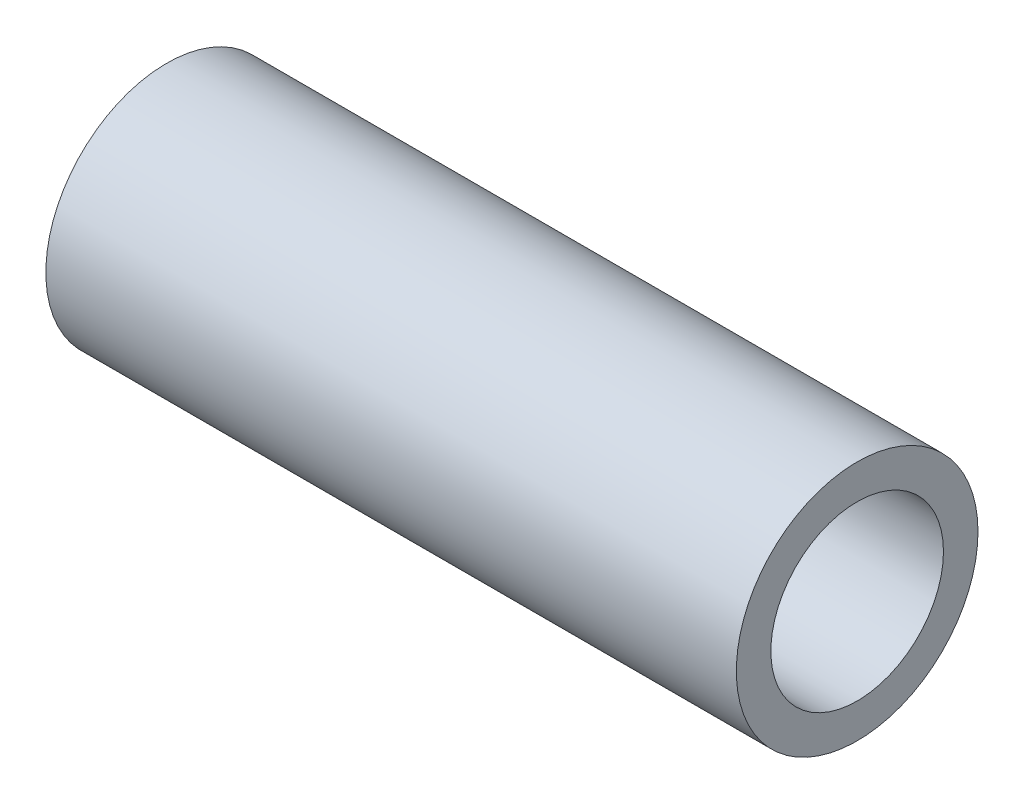
ISO-10303-21;
HEADER;
FILE_DESCRIPTION(('STEP AP214'),'2;1');
FILE_NAME('part.step','',(''),(''),'','','');
FILE_SCHEMA(('AUTOMOTIVE_DESIGN { 1 0 10303 214 1 1 1 1 }'));
ENDSEC;
DATA;
#1=APPLICATION_CONTEXT('core data for automotive mechanical design processes');
#2=APPLICATION_PROTOCOL_DEFINITION('international standard','automotive_design',2000,#1);
#3=PRODUCT_CONTEXT('',#1,'mechanical');
#4=PRODUCT('Part','Part','',(#3));
#5=PRODUCT_RELATED_PRODUCT_CATEGORY('part','',(#4));
#6=PRODUCT_DEFINITION_FORMATION('','',#4);
#7=PRODUCT_DEFINITION_CONTEXT('part definition',#1,'design');
#8=PRODUCT_DEFINITION('design','',#6,#7);
#9=PRODUCT_DEFINITION_SHAPE('','',#8);
#10=(LENGTH_UNIT() NAMED_UNIT(*) SI_UNIT(.MILLI.,.METRE.));
#11=(NAMED_UNIT(*) PLANE_ANGLE_UNIT() SI_UNIT($,.RADIAN.));
#12=(NAMED_UNIT(*) SI_UNIT($,.STERADIAN.) SOLID_ANGLE_UNIT());
#13=UNCERTAINTY_MEASURE_WITH_UNIT(LENGTH_MEASURE(1.E-05),#10,'distance_accuracy_value','');
#14=(GEOMETRIC_REPRESENTATION_CONTEXT(3) GLOBAL_UNCERTAINTY_ASSIGNED_CONTEXT((#13)) GLOBAL_UNIT_ASSIGNED_CONTEXT((#10,
#11,#12)) REPRESENTATION_CONTEXT('',''));
#15=CARTESIAN_POINT('',(0.,0.,0.));
#16=DIRECTION('',(0.,0.,1.));
#17=DIRECTION('',(1.,0.,0.));
#18=AXIS2_PLACEMENT_3D('',#15,#16,#17);
#19=CARTESIAN_POINT('',(15.875,0.,0.));
#20=DIRECTION('',(1.,0.,0.));
#21=DIRECTION('',(0.,0.,-1.));
#22=AXIS2_PLACEMENT_3D('',#19,#20,#21);
#23=PLANE('',#22);
#24=CARTESIAN_POINT('',(15.875,0.,0.));
#25=DIRECTION('',(1.,0.,0.));
#26=DIRECTION('',(0.,0.,-1.));
#27=AXIS2_PLACEMENT_3D('',#24,#25,#26);
#28=CIRCLE('',#27,5.55625);
#29=CARTESIAN_POINT('',(15.875,0.,-5.55625));
#30=VERTEX_POINT('',#29);
#31=EDGE_CURVE('E10',#30,#30,#28,.T.);
#32=ORIENTED_EDGE('',*,*,#31,.T.);
#33=EDGE_LOOP('',(#32));
#34=FACE_BOUND('',#33,.T.);
#35=CARTESIAN_POINT('',(15.875,0.,0.));
#36=DIRECTION('',(1.,0.,0.));
#37=DIRECTION('',(0.,0.,-1.));
#38=AXIS2_PLACEMENT_3D('',#35,#36,#37);
#39=CIRCLE('',#38,3.96875);
#40=CARTESIAN_POINT('',(15.875,0.,-3.96875));
#41=VERTEX_POINT('',#40);
#42=EDGE_CURVE('E43',#41,#41,#39,.T.);
#43=ORIENTED_EDGE('',*,*,#42,.F.);
#44=EDGE_LOOP('',(#43));
#45=FACE_BOUND('',#44,.T.);
#46=ADVANCED_FACE('F32',(#34,#45),#23,.T.);
#47=CARTESIAN_POINT('',(-15.875,0.,0.));
#48=DIRECTION('',(1.,0.,0.));
#49=DIRECTION('',(0.,0.,-1.));
#50=AXIS2_PLACEMENT_3D('',#47,#48,#49);
#51=PLANE('',#50);
#52=CARTESIAN_POINT('',(-15.875,0.,0.));
#53=DIRECTION('',(1.,0.,0.));
#54=DIRECTION('',(0.,0.,-1.));
#55=AXIS2_PLACEMENT_3D('',#52,#53,#54);
#56=CIRCLE('',#55,5.55625);
#57=CARTESIAN_POINT('',(-15.875,0.,-5.55625));
#58=VERTEX_POINT('',#57);
#59=EDGE_CURVE('E36',#58,#58,#56,.T.);
#60=ORIENTED_EDGE('',*,*,#59,.F.);
#61=EDGE_LOOP('',(#60));
#62=FACE_BOUND('',#61,.T.);
#63=CARTESIAN_POINT('',(-15.875,0.,0.));
#64=DIRECTION('',(1.,0.,0.));
#65=DIRECTION('',(0.,0.,-1.));
#66=AXIS2_PLACEMENT_3D('',#63,#64,#65);
#67=CIRCLE('',#66,3.96875);
#68=CARTESIAN_POINT('',(-15.875,0.,-3.96875));
#69=VERTEX_POINT('',#68);
#70=EDGE_CURVE('E45',#69,#69,#67,.T.);
#71=ORIENTED_EDGE('',*,*,#70,.T.);
#72=EDGE_LOOP('',(#71));
#73=FACE_BOUND('',#72,.T.);
#74=ADVANCED_FACE('F55',(#62,#73),#51,.F.);
#75=CARTESIAN_POINT('',(15.875,0.,0.));
#76=DIRECTION('',(-1.,0.,0.));
#77=DIRECTION('',(0.,0.,1.));
#78=AXIS2_PLACEMENT_3D('',#75,#76,#77);
#79=CYLINDRICAL_SURFACE('',#78,5.55625);
#80=ORIENTED_EDGE('',*,*,#31,.F.);
#81=EDGE_LOOP('',(#80));
#82=FACE_BOUND('',#81,.T.);
#83=ORIENTED_EDGE('',*,*,#59,.T.);
#84=EDGE_LOOP('',(#83));
#85=FACE_BOUND('',#84,.T.);
#86=ADVANCED_FACE('F34',(#82,#85),#79,.T.);
#87=CARTESIAN_POINT('',(15.875,0.,0.));
#88=DIRECTION('',(-1.,0.,0.));
#89=DIRECTION('',(0.,0.,1.));
#90=AXIS2_PLACEMENT_3D('',#87,#88,#89);
#91=CYLINDRICAL_SURFACE('',#90,3.96875);
#92=ORIENTED_EDGE('',*,*,#42,.T.);
#93=EDGE_LOOP('',(#92));
#94=FACE_BOUND('',#93,.T.);
#95=ORIENTED_EDGE('',*,*,#70,.F.);
#96=EDGE_LOOP('',(#95));
#97=FACE_BOUND('',#96,.T.);
#98=ADVANCED_FACE('F51',(#94,#97),#91,.F.);
#99=CLOSED_SHELL('',(#46,#74,#86,#98));
#100=MANIFOLD_SOLID_BREP('B2',#99);
#101=ADVANCED_BREP_SHAPE_REPRESENTATION('',(#18,#100),#14);
#102=SHAPE_DEFINITION_REPRESENTATION(#9,#101);
ENDSEC;
END-ISO-10303-21;
